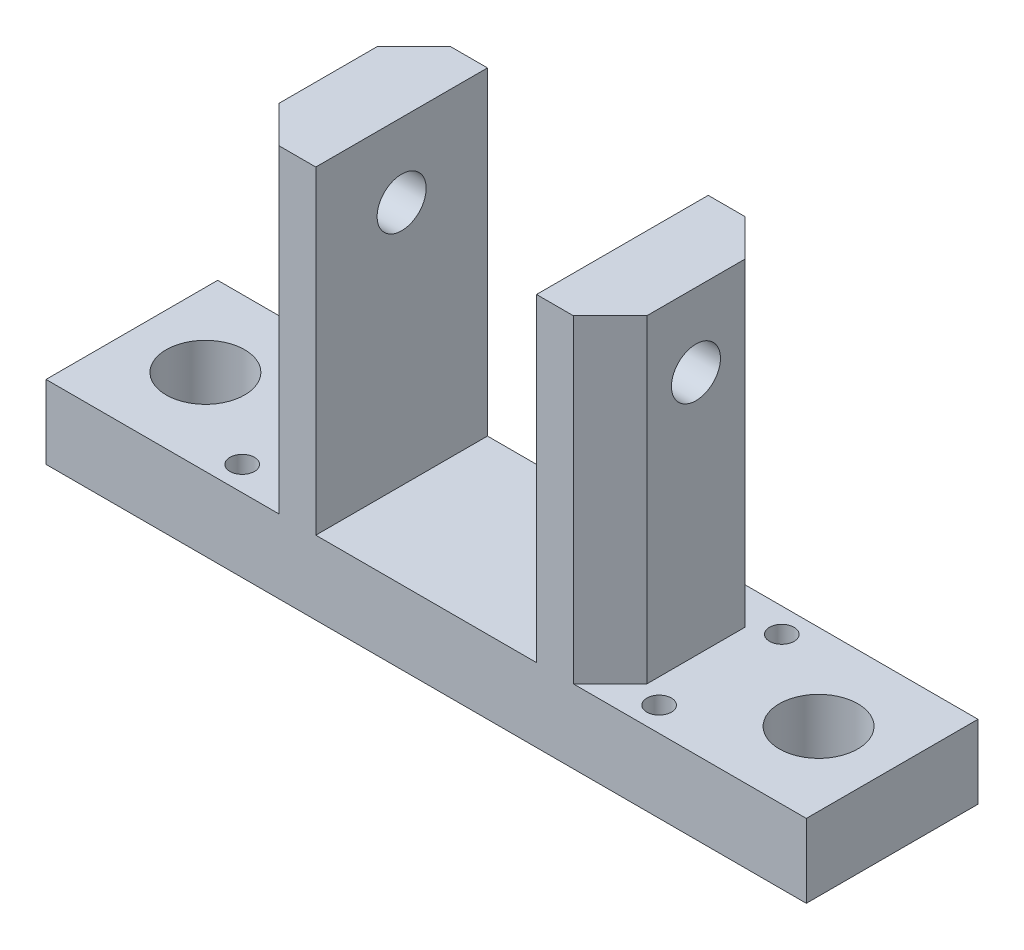
ISO-10303-21;
HEADER;
FILE_DESCRIPTION(('STEP AP214'),'2;1');
FILE_NAME('part.step','',(''),(''),'','','');
FILE_SCHEMA(('AUTOMOTIVE_DESIGN { 1 0 10303 214 1 1 1 1 }'));
ENDSEC;
DATA;
#1=APPLICATION_CONTEXT('core data for automotive mechanical design processes');
#2=APPLICATION_PROTOCOL_DEFINITION('international standard','automotive_design',2000,#1);
#3=PRODUCT_CONTEXT('',#1,'mechanical');
#4=PRODUCT('Part','Part','',(#3));
#5=PRODUCT_RELATED_PRODUCT_CATEGORY('part','',(#4));
#6=PRODUCT_DEFINITION_FORMATION('','',#4);
#7=PRODUCT_DEFINITION_CONTEXT('part definition',#1,'design');
#8=PRODUCT_DEFINITION('design','',#6,#7);
#9=PRODUCT_DEFINITION_SHAPE('','',#8);
#10=(LENGTH_UNIT() NAMED_UNIT(*) SI_UNIT(.MILLI.,.METRE.));
#11=(NAMED_UNIT(*) PLANE_ANGLE_UNIT() SI_UNIT($,.RADIAN.));
#12=(NAMED_UNIT(*) SI_UNIT($,.STERADIAN.) SOLID_ANGLE_UNIT());
#13=UNCERTAINTY_MEASURE_WITH_UNIT(LENGTH_MEASURE(1.E-05),#10,'distance_accuracy_value','');
#14=(GEOMETRIC_REPRESENTATION_CONTEXT(3) GLOBAL_UNCERTAINTY_ASSIGNED_CONTEXT((#13)) GLOBAL_UNIT_ASSIGNED_CONTEXT((#10,
#11,#12)) REPRESENTATION_CONTEXT('',''));
#15=CARTESIAN_POINT('',(0.,0.,0.));
#16=DIRECTION('',(0.,0.,1.));
#17=DIRECTION('',(1.,0.,0.));
#18=AXIS2_PLACEMENT_3D('',#15,#16,#17);
#19=CARTESIAN_POINT('',(0.,3.,3.5));
#20=DIRECTION('',(-1.,0.,0.));
#21=DIRECTION('',(0.,-1.,0.));
#22=AXIS2_PLACEMENT_3D('',#19,#20,#21);
#23=PLANE('',#22);
#24=DIRECTION('',(0.,1.,0.));
#25=VECTOR('',#24,1.);
#26=CARTESIAN_POINT('',(0.,3.,-3.5));
#27=LINE('',#26,#25);
#28=CARTESIAN_POINT('',(0.,0.,-3.5));
#29=VERTEX_POINT('',#28);
#30=CARTESIAN_POINT('',(0.,3.,-3.5));
#31=VERTEX_POINT('',#30);
#32=EDGE_CURVE('E147',#29,#31,#27,.T.);
#33=ORIENTED_EDGE('',*,*,#32,.T.);
#34=DIRECTION('',(0.,0.,-1.));
#35=VECTOR('',#34,1.);
#36=CARTESIAN_POINT('',(0.,3.,3.5));
#37=LINE('',#36,#35);
#38=CARTESIAN_POINT('',(0.,3.,3.5));
#39=VERTEX_POINT('',#38);
#40=EDGE_CURVE('E155',#39,#31,#37,.T.);
#41=ORIENTED_EDGE('',*,*,#40,.F.);
#42=DIRECTION('',(0.,1.,0.));
#43=VECTOR('',#42,1.);
#44=CARTESIAN_POINT('',(0.,3.,3.5));
#45=LINE('',#44,#43);
#46=CARTESIAN_POINT('',(0.,0.,3.5));
#47=VERTEX_POINT('',#46);
#48=EDGE_CURVE('E190',#47,#39,#45,.T.);
#49=ORIENTED_EDGE('',*,*,#48,.F.);
#50=DIRECTION('',(0.,0.,-1.));
#51=VECTOR('',#50,1.);
#52=CARTESIAN_POINT('',(0.,0.,3.5));
#53=LINE('',#52,#51);
#54=EDGE_CURVE('E167',#47,#29,#53,.T.);
#55=ORIENTED_EDGE('',*,*,#54,.T.);
#56=EDGE_LOOP('',(#33,#41,#49,#55));
#57=FACE_BOUND('',#56,.T.);
#58=ADVANCED_FACE('F27',(#57),#23,.F.);
#59=CARTESIAN_POINT('',(-8.,3.,3.5));
#60=DIRECTION('',(0.,-1.,0.));
#61=DIRECTION('',(0.,0.,-1.));
#62=AXIS2_PLACEMENT_3D('',#59,#60,#61);
#63=PLANE('',#62);
#64=CARTESIAN_POINT('',(-7.,3.,-2.5));
#65=DIRECTION('',(0.,1.,0.));
#66=DIRECTION('',(0.,0.,1.));
#67=AXIS2_PLACEMENT_3D('',#64,#65,#66);
#68=CIRCLE('',#67,0.5);
#69=CARTESIAN_POINT('',(-7.,3.,-2.));
#70=VERTEX_POINT('',#69);
#71=EDGE_CURVE('E509',#70,#70,#68,.T.);
#72=ORIENTED_EDGE('',*,*,#71,.F.);
#73=EDGE_LOOP('',(#72));
#74=FACE_BOUND('',#73,.T.);
#75=CARTESIAN_POINT('',(-7.,3.,2.5));
#76=DIRECTION('',(0.,1.,0.));
#77=DIRECTION('',(0.,0.,1.));
#78=AXIS2_PLACEMENT_3D('',#75,#76,#77);
#79=CIRCLE('',#78,0.5);
#80=CARTESIAN_POINT('',(-7.,3.,3.));
#81=VERTEX_POINT('',#80);
#82=EDGE_CURVE('E515',#81,#81,#79,.T.);
#83=ORIENTED_EDGE('',*,*,#82,.F.);
#84=EDGE_LOOP('',(#83));
#85=FACE_BOUND('',#84,.T.);
#86=CARTESIAN_POINT('',(-3.,3.,0.));
#87=DIRECTION('',(0.,1.,0.));
#88=DIRECTION('',(0.,0.,1.));
#89=AXIS2_PLACEMENT_3D('',#86,#87,#88);
#90=CIRCLE('',#89,1.6);
#91=CARTESIAN_POINT('',(-3.,3.,1.6));
#92=VERTEX_POINT('',#91);
#93=EDGE_CURVE('E533',#92,#92,#90,.T.);
#94=ORIENTED_EDGE('',*,*,#93,.F.);
#95=EDGE_LOOP('',(#94));
#96=FACE_BOUND('',#95,.T.);
#97=DIRECTION('',(-1.,0.,0.));
#98=VECTOR('',#97,1.);
#99=CARTESIAN_POINT('',(-8.,3.,-3.5));
#100=LINE('',#99,#98);
#101=CARTESIAN_POINT('',(-9.5,3.,-3.5));
#102=VERTEX_POINT('',#101);
#103=EDGE_CURVE('E141',#31,#102,#100,.T.);
#104=ORIENTED_EDGE('',*,*,#103,.T.);
#105=DIRECTION('',(-0.707106781186548,0.,-0.707106781186547));
#106=VECTOR('',#105,1.);
#107=CARTESIAN_POINT('',(-5.25,3.,0.749999999999994));
#108=LINE('',#107,#106);
#109=CARTESIAN_POINT('',(-8.,3.,-2.));
#110=VERTEX_POINT('',#109);
#111=EDGE_CURVE('E263',#102,#110,#108,.F.);
#112=ORIENTED_EDGE('',*,*,#111,.T.);
#113=DIRECTION('',(0.,0.,-1.));
#114=VECTOR('',#113,1.);
#115=CARTESIAN_POINT('',(-8.,3.,3.5));
#116=LINE('',#115,#114);
#117=CARTESIAN_POINT('',(-8.,3.,2.));
#118=VERTEX_POINT('',#117);
#119=EDGE_CURVE('E163',#118,#110,#116,.T.);
#120=ORIENTED_EDGE('',*,*,#119,.F.);
#121=DIRECTION('',(-0.707106781186546,0.,0.707106781186549));
#122=VECTOR('',#121,1.);
#123=CARTESIAN_POINT('',(-8.75,3.,2.75));
#124=LINE('',#123,#122);
#125=CARTESIAN_POINT('',(-9.49999999999999,3.,3.5));
#126=VERTEX_POINT('',#125);
#127=EDGE_CURVE('E265',#118,#126,#124,.T.);
#128=ORIENTED_EDGE('',*,*,#127,.T.);
#129=DIRECTION('',(-1.,0.,0.));
#130=VECTOR('',#129,1.);
#131=CARTESIAN_POINT('',(-8.,3.,3.5));
#132=LINE('',#131,#130);
#133=EDGE_CURVE('E158',#39,#126,#132,.T.);
#134=ORIENTED_EDGE('',*,*,#133,.F.);
#135=ORIENTED_EDGE('',*,*,#40,.T.);
#136=EDGE_LOOP('',(#104,#112,#120,#128,#134,#135));
#137=FACE_BOUND('',#136,.T.);
#138=ADVANCED_FACE('F156',(#74,#85,#96,#137),#63,.F.);
#139=CARTESIAN_POINT('',(-8.,16.,3.5));
#140=DIRECTION('',(-1.,0.,0.));
#141=DIRECTION('',(0.,-1.,0.));
#142=AXIS2_PLACEMENT_3D('',#139,#140,#141);
#143=PLANE('',#142);
#144=CARTESIAN_POINT('',(-8.,13.,0.));
#145=DIRECTION('',(-1.,0.,0.));
#146=DIRECTION('',(0.,-1.,0.));
#147=AXIS2_PLACEMENT_3D('',#144,#145,#146);
#148=CIRCLE('',#147,1.);
#149=CARTESIAN_POINT('',(-8.,12.,0.));
#150=VERTEX_POINT('',#149);
#151=EDGE_CURVE('E503',#150,#150,#148,.T.);
#152=ORIENTED_EDGE('',*,*,#151,.T.);
#153=EDGE_LOOP('',(#152));
#154=FACE_BOUND('',#153,.T.);
#155=ORIENTED_EDGE('',*,*,#119,.T.);
#156=DIRECTION('',(0.,1.,0.));
#157=VECTOR('',#156,1.);
#158=CARTESIAN_POINT('',(-8.,16.,-2.));
#159=LINE('',#158,#157);
#160=CARTESIAN_POINT('',(-8.,16.,-2.));
#161=VERTEX_POINT('',#160);
#162=EDGE_CURVE('E240',#110,#161,#159,.T.);
#163=ORIENTED_EDGE('',*,*,#162,.T.);
#164=DIRECTION('',(0.,0.,-1.));
#165=VECTOR('',#164,1.);
#166=CARTESIAN_POINT('',(-8.,16.,3.5));
#167=LINE('',#166,#165);
#168=CARTESIAN_POINT('',(-8.,16.,2.));
#169=VERTEX_POINT('',#168);
#170=EDGE_CURVE('E234',#169,#161,#167,.T.);
#171=ORIENTED_EDGE('',*,*,#170,.F.);
#172=DIRECTION('',(0.,-1.,0.));
#173=VECTOR('',#172,1.);
#174=CARTESIAN_POINT('',(-8.,3.,2.));
#175=LINE('',#174,#173);
#176=EDGE_CURVE('E162',#169,#118,#175,.T.);
#177=ORIENTED_EDGE('',*,*,#176,.T.);
#178=EDGE_LOOP('',(#155,#163,#171,#177));
#179=FACE_BOUND('',#178,.T.);
#180=ADVANCED_FACE('F312',(#154,#179),#143,.F.);
#181=CARTESIAN_POINT('',(-11.,16.,3.5));
#182=DIRECTION('',(0.,-1.,0.));
#183=DIRECTION('',(0.,0.,-1.));
#184=AXIS2_PLACEMENT_3D('',#181,#182,#183);
#185=PLANE('',#184);
#186=ORIENTED_EDGE('',*,*,#170,.T.);
#187=DIRECTION('',(0.707106781186548,0.,0.707106781186547));
#188=VECTOR('',#187,1.);
#189=CARTESIAN_POINT('',(-8.,16.,-2.));
#190=LINE('',#189,#188);
#191=CARTESIAN_POINT('',(-9.50000000000001,16.,-3.5));
#192=VERTEX_POINT('',#191);
#193=EDGE_CURVE('E245',#161,#192,#190,.F.);
#194=ORIENTED_EDGE('',*,*,#193,.T.);
#195=DIRECTION('',(-1.,0.,0.));
#196=VECTOR('',#195,1.);
#197=CARTESIAN_POINT('',(-11.,16.,-3.5));
#198=LINE('',#197,#196);
#199=CARTESIAN_POINT('',(-11.,16.,-3.5));
#200=VERTEX_POINT('',#199);
#201=EDGE_CURVE('E152',#192,#200,#198,.T.);
#202=ORIENTED_EDGE('',*,*,#201,.T.);
#203=DIRECTION('',(0.,0.,-1.));
#204=VECTOR('',#203,1.);
#205=CARTESIAN_POINT('',(-11.,16.,3.5));
#206=LINE('',#205,#204);
#207=CARTESIAN_POINT('',(-11.,16.,3.5));
#208=VERTEX_POINT('',#207);
#209=EDGE_CURVE('E231',#208,#200,#206,.T.);
#210=ORIENTED_EDGE('',*,*,#209,.F.);
#211=DIRECTION('',(-1.,0.,0.));
#212=VECTOR('',#211,1.);
#213=CARTESIAN_POINT('',(-11.,16.,3.5));
#214=LINE('',#213,#212);
#215=CARTESIAN_POINT('',(-9.5,16.,3.5));
#216=VERTEX_POINT('',#215);
#217=EDGE_CURVE('E193',#216,#208,#214,.T.);
#218=ORIENTED_EDGE('',*,*,#217,.F.);
#219=DIRECTION('',(0.707106781186546,0.,-0.707106781186549));
#220=VECTOR('',#219,1.);
#221=CARTESIAN_POINT('',(-9.49999999999999,16.,3.5));
#222=LINE('',#221,#220);
#223=EDGE_CURVE('E243',#216,#169,#222,.T.);
#224=ORIENTED_EDGE('',*,*,#223,.T.);
#225=EDGE_LOOP('',(#186,#194,#202,#210,#218,#224));
#226=FACE_BOUND('',#225,.T.);
#227=ADVANCED_FACE('F309',(#226),#185,.F.);
#228=CARTESIAN_POINT('',(-11.,3.,3.5));
#229=DIRECTION('',(1.,0.,0.));
#230=DIRECTION('',(0.,0.,-1.));
#231=AXIS2_PLACEMENT_3D('',#228,#229,#230);
#232=PLANE('',#231);
#233=CARTESIAN_POINT('',(-11.,13.,0.));
#234=DIRECTION('',(1.,0.,0.));
#235=DIRECTION('',(0.,0.,-1.));
#236=AXIS2_PLACEMENT_3D('',#233,#234,#235);
#237=CIRCLE('',#236,1.);
#238=CARTESIAN_POINT('',(-11.,13.,-1.));
#239=VERTEX_POINT('',#238);
#240=EDGE_CURVE('E500',#239,#239,#237,.T.);
#241=ORIENTED_EDGE('',*,*,#240,.T.);
#242=EDGE_LOOP('',(#241));
#243=FACE_BOUND('',#242,.T.);
#244=DIRECTION('',(0.,-1.,0.));
#245=VECTOR('',#244,1.);
#246=CARTESIAN_POINT('',(-11.,3.,-3.5));
#247=LINE('',#246,#245);
#248=CARTESIAN_POINT('',(-11.,3.,-3.5));
#249=VERTEX_POINT('',#248);
#250=EDGE_CURVE('E176',#200,#249,#247,.T.);
#251=ORIENTED_EDGE('',*,*,#250,.T.);
#252=DIRECTION('',(0.,0.,-1.));
#253=VECTOR('',#252,1.);
#254=CARTESIAN_POINT('',(-11.,3.,3.5));
#255=LINE('',#254,#253);
#256=CARTESIAN_POINT('',(-11.,3.,3.5));
#257=VERTEX_POINT('',#256);
#258=EDGE_CURVE('E228',#257,#249,#255,.T.);
#259=ORIENTED_EDGE('',*,*,#258,.F.);
#260=DIRECTION('',(0.,-1.,0.));
#261=VECTOR('',#260,1.);
#262=CARTESIAN_POINT('',(-11.,3.,3.5));
#263=LINE('',#262,#261);
#264=EDGE_CURVE('E195',#208,#257,#263,.T.);
#265=ORIENTED_EDGE('',*,*,#264,.F.);
#266=ORIENTED_EDGE('',*,*,#209,.T.);
#267=EDGE_LOOP('',(#251,#259,#265,#266));
#268=FACE_BOUND('',#267,.T.);
#269=ADVANCED_FACE('F319',(#243,#268),#232,.F.);
#270=CARTESIAN_POINT('',(-20.,3.,3.5));
#271=DIRECTION('',(0.,-1.,0.));
#272=DIRECTION('',(1.,0.,0.));
#273=AXIS2_PLACEMENT_3D('',#270,#271,#272);
#274=PLANE('',#273);
#275=DIRECTION('',(-1.,0.,0.));
#276=VECTOR('',#275,1.);
#277=CARTESIAN_POINT('',(-20.,3.,-3.5));
#278=LINE('',#277,#276);
#279=CARTESIAN_POINT('',(-20.,3.,-3.5));
#280=VERTEX_POINT('',#279);
#281=EDGE_CURVE('E178',#249,#280,#278,.T.);
#282=ORIENTED_EDGE('',*,*,#281,.T.);
#283=DIRECTION('',(0.,0.,-1.));
#284=VECTOR('',#283,1.);
#285=CARTESIAN_POINT('',(-20.,3.,3.5));
#286=LINE('',#285,#284);
#287=CARTESIAN_POINT('',(-20.,3.,3.5));
#288=VERTEX_POINT('',#287);
#289=EDGE_CURVE('E225',#288,#280,#286,.T.);
#290=ORIENTED_EDGE('',*,*,#289,.F.);
#291=DIRECTION('',(-1.,0.,0.));
#292=VECTOR('',#291,1.);
#293=CARTESIAN_POINT('',(-20.,3.,3.5));
#294=LINE('',#293,#292);
#295=EDGE_CURVE('E197',#257,#288,#294,.T.);
#296=ORIENTED_EDGE('',*,*,#295,.F.);
#297=ORIENTED_EDGE('',*,*,#258,.T.);
#298=EDGE_LOOP('',(#282,#290,#296,#297));
#299=FACE_BOUND('',#298,.T.);
#300=ADVANCED_FACE('F322',(#299),#274,.F.);
#301=CARTESIAN_POINT('',(-20.,16.,3.5));
#302=DIRECTION('',(-1.,0.,0.));
#303=DIRECTION('',(0.,0.,1.));
#304=AXIS2_PLACEMENT_3D('',#301,#302,#303);
#305=PLANE('',#304);
#306=CARTESIAN_POINT('',(-20.,13.,0.));
#307=DIRECTION('',(-1.,0.,0.));
#308=DIRECTION('',(0.,0.,1.));
#309=AXIS2_PLACEMENT_3D('',#306,#307,#308);
#310=CIRCLE('',#309,1.);
#311=CARTESIAN_POINT('',(-20.,13.,1.));
#312=VERTEX_POINT('',#311);
#313=EDGE_CURVE('E499',#312,#312,#310,.T.);
#314=ORIENTED_EDGE('',*,*,#313,.T.);
#315=EDGE_LOOP('',(#314));
#316=FACE_BOUND('',#315,.T.);
#317=DIRECTION('',(0.,1.,0.));
#318=VECTOR('',#317,1.);
#319=CARTESIAN_POINT('',(-20.,16.,-3.5));
#320=LINE('',#319,#318);
#321=CARTESIAN_POINT('',(-20.,16.,-3.5));
#322=VERTEX_POINT('',#321);
#323=EDGE_CURVE('E180',#280,#322,#320,.T.);
#324=ORIENTED_EDGE('',*,*,#323,.T.);
#325=DIRECTION('',(0.,0.,-1.));
#326=VECTOR('',#325,1.);
#327=CARTESIAN_POINT('',(-20.,16.,3.5));
#328=LINE('',#327,#326);
#329=CARTESIAN_POINT('',(-20.,16.,3.5));
#330=VERTEX_POINT('',#329);
#331=EDGE_CURVE('E222',#330,#322,#328,.T.);
#332=ORIENTED_EDGE('',*,*,#331,.F.);
#333=DIRECTION('',(0.,1.,0.));
#334=VECTOR('',#333,1.);
#335=CARTESIAN_POINT('',(-20.,16.,3.5));
#336=LINE('',#335,#334);
#337=EDGE_CURVE('E199',#288,#330,#336,.T.);
#338=ORIENTED_EDGE('',*,*,#337,.F.);
#339=ORIENTED_EDGE('',*,*,#289,.T.);
#340=EDGE_LOOP('',(#324,#332,#338,#339));
#341=FACE_BOUND('',#340,.T.);
#342=ADVANCED_FACE('F285',(#316,#341),#305,.F.);
#343=CARTESIAN_POINT('',(-23.,16.,3.5));
#344=DIRECTION('',(0.,-1.,0.));
#345=DIRECTION('',(0.,0.,-1.));
#346=AXIS2_PLACEMENT_3D('',#343,#344,#345);
#347=PLANE('',#346);
#348=DIRECTION('',(0.,0.,-1.));
#349=VECTOR('',#348,1.);
#350=CARTESIAN_POINT('',(-23.,16.,3.5));
#351=LINE('',#350,#349);
#352=CARTESIAN_POINT('',(-23.,16.,2.));
#353=VERTEX_POINT('',#352);
#354=CARTESIAN_POINT('',(-23.,16.,-2.));
#355=VERTEX_POINT('',#354);
#356=EDGE_CURVE('E220',#353,#355,#351,.T.);
#357=ORIENTED_EDGE('',*,*,#356,.F.);
#358=DIRECTION('',(0.707106781186545,0.,0.70710678118655));
#359=VECTOR('',#358,1.);
#360=CARTESIAN_POINT('',(-21.5,16.,3.5));
#361=LINE('',#360,#359);
#362=CARTESIAN_POINT('',(-21.5,16.,3.5));
#363=VERTEX_POINT('',#362);
#364=EDGE_CURVE('E261',#353,#363,#361,.T.);
#365=ORIENTED_EDGE('',*,*,#364,.T.);
#366=DIRECTION('',(-1.,0.,0.));
#367=VECTOR('',#366,1.);
#368=CARTESIAN_POINT('',(-23.,16.,3.5));
#369=LINE('',#368,#367);
#370=EDGE_CURVE('E201',#330,#363,#369,.T.);
#371=ORIENTED_EDGE('',*,*,#370,.F.);
#372=ORIENTED_EDGE('',*,*,#331,.T.);
#373=DIRECTION('',(-1.,0.,0.));
#374=VECTOR('',#373,1.);
#375=CARTESIAN_POINT('',(-23.,16.,-3.5));
#376=LINE('',#375,#374);
#377=CARTESIAN_POINT('',(-21.5,16.,-3.5));
#378=VERTEX_POINT('',#377);
#379=EDGE_CURVE('E182',#322,#378,#376,.T.);
#380=ORIENTED_EDGE('',*,*,#379,.T.);
#381=DIRECTION('',(0.707106781186548,0.,-0.707106781186547));
#382=VECTOR('',#381,1.);
#383=CARTESIAN_POINT('',(-23.,16.,-2.));
#384=LINE('',#383,#382);
#385=EDGE_CURVE('E41',#378,#355,#384,.F.);
#386=ORIENTED_EDGE('',*,*,#385,.T.);
#387=EDGE_LOOP('',(#357,#365,#371,#372,#380,#386));
#388=FACE_BOUND('',#387,.T.);
#389=ADVANCED_FACE('F277',(#388),#347,.F.);
#390=CARTESIAN_POINT('',(-23.,3.,3.5));
#391=DIRECTION('',(1.,0.,0.));
#392=DIRECTION('',(0.,0.,-1.));
#393=AXIS2_PLACEMENT_3D('',#390,#391,#392);
#394=PLANE('',#393);
#395=CARTESIAN_POINT('',(-23.,13.,0.));
#396=DIRECTION('',(-1.,0.,0.));
#397=DIRECTION('',(0.,0.,1.));
#398=AXIS2_PLACEMENT_3D('',#395,#396,#397);
#399=CIRCLE('',#398,1.);
#400=CARTESIAN_POINT('',(-23.,13.,1.));
#401=VERTEX_POINT('',#400);
#402=EDGE_CURVE('E496',#401,#401,#399,.T.);
#403=ORIENTED_EDGE('',*,*,#402,.F.);
#404=EDGE_LOOP('',(#403));
#405=FACE_BOUND('',#404,.T.);
#406=DIRECTION('',(0.,0.,-1.));
#407=VECTOR('',#406,1.);
#408=CARTESIAN_POINT('',(-23.,3.,3.5));
#409=LINE('',#408,#407);
#410=CARTESIAN_POINT('',(-23.,3.,2.));
#411=VERTEX_POINT('',#410);
#412=CARTESIAN_POINT('',(-23.,3.,-2.));
#413=VERTEX_POINT('',#412);
#414=EDGE_CURVE('E217',#411,#413,#409,.T.);
#415=ORIENTED_EDGE('',*,*,#414,.F.);
#416=DIRECTION('',(0.,1.,0.));
#417=VECTOR('',#416,1.);
#418=CARTESIAN_POINT('',(-23.,16.,2.));
#419=LINE('',#418,#417);
#420=EDGE_CURVE('E48',#411,#353,#419,.T.);
#421=ORIENTED_EDGE('',*,*,#420,.T.);
#422=ORIENTED_EDGE('',*,*,#356,.T.);
#423=DIRECTION('',(0.,-1.,0.));
#424=VECTOR('',#423,1.);
#425=CARTESIAN_POINT('',(-23.,3.,-2.));
#426=LINE('',#425,#424);
#427=EDGE_CURVE('E256',#355,#413,#426,.T.);
#428=ORIENTED_EDGE('',*,*,#427,.T.);
#429=EDGE_LOOP('',(#415,#421,#422,#428));
#430=FACE_BOUND('',#429,.T.);
#431=ADVANCED_FACE('F272',(#405,#430),#394,.F.);
#432=CARTESIAN_POINT('',(-31.,3.,3.5));
#433=DIRECTION('',(0.,-1.,0.));
#434=DIRECTION('',(0.,0.,-1.));
#435=AXIS2_PLACEMENT_3D('',#432,#433,#434);
#436=PLANE('',#435);
#437=CARTESIAN_POINT('',(-24.,3.,2.5));
#438=DIRECTION('',(0.,1.,0.));
#439=DIRECTION('',(0.,0.,1.));
#440=AXIS2_PLACEMENT_3D('',#437,#438,#439);
#441=CIRCLE('',#440,0.499999999999999);
#442=CARTESIAN_POINT('',(-24.,3.,3.));
#443=VERTEX_POINT('',#442);
#444=EDGE_CURVE('E521',#443,#443,#441,.T.);
#445=ORIENTED_EDGE('',*,*,#444,.F.);
#446=EDGE_LOOP('',(#445));
#447=FACE_BOUND('',#446,.T.);
#448=CARTESIAN_POINT('',(-24.,3.,-2.5));
#449=DIRECTION('',(0.,1.,0.));
#450=DIRECTION('',(0.,0.,1.));
#451=AXIS2_PLACEMENT_3D('',#448,#449,#450);
#452=CIRCLE('',#451,0.499999999999999);
#453=CARTESIAN_POINT('',(-24.,3.,-2.));
#454=VERTEX_POINT('',#453);
#455=EDGE_CURVE('E527',#454,#454,#452,.T.);
#456=ORIENTED_EDGE('',*,*,#455,.F.);
#457=EDGE_LOOP('',(#456));
#458=FACE_BOUND('',#457,.T.);
#459=CARTESIAN_POINT('',(-28.,3.,0.));
#460=DIRECTION('',(0.,1.,0.));
#461=DIRECTION('',(0.,0.,1.));
#462=AXIS2_PLACEMENT_3D('',#459,#460,#461);
#463=CIRCLE('',#462,1.6);
#464=CARTESIAN_POINT('',(-28.,3.,1.6));
#465=VERTEX_POINT('',#464);
#466=EDGE_CURVE('E171',#465,#465,#463,.T.);
#467=ORIENTED_EDGE('',*,*,#466,.F.);
#468=EDGE_LOOP('',(#467));
#469=FACE_BOUND('',#468,.T.);
#470=DIRECTION('',(-1.,0.,0.));
#471=VECTOR('',#470,1.);
#472=CARTESIAN_POINT('',(-31.,3.,-3.5));
#473=LINE('',#472,#471);
#474=CARTESIAN_POINT('',(-21.5,3.,-3.5));
#475=VERTEX_POINT('',#474);
#476=CARTESIAN_POINT('',(-31.,3.,-3.5));
#477=VERTEX_POINT('',#476);
#478=EDGE_CURVE('E184',#475,#477,#473,.T.);
#479=ORIENTED_EDGE('',*,*,#478,.T.);
#480=DIRECTION('',(0.,0.,-1.));
#481=VECTOR('',#480,1.);
#482=CARTESIAN_POINT('',(-31.,3.,3.5));
#483=LINE('',#482,#481);
#484=CARTESIAN_POINT('',(-31.,3.,3.5));
#485=VERTEX_POINT('',#484);
#486=EDGE_CURVE('E214',#485,#477,#483,.T.);
#487=ORIENTED_EDGE('',*,*,#486,.F.);
#488=DIRECTION('',(-1.,0.,0.));
#489=VECTOR('',#488,1.);
#490=CARTESIAN_POINT('',(-31.,3.,3.5));
#491=LINE('',#490,#489);
#492=CARTESIAN_POINT('',(-21.5,3.,3.5));
#493=VERTEX_POINT('',#492);
#494=EDGE_CURVE('E204',#493,#485,#491,.T.);
#495=ORIENTED_EDGE('',*,*,#494,.F.);
#496=DIRECTION('',(-0.707106781186545,0.,-0.70710678118655));
#497=VECTOR('',#496,1.);
#498=CARTESIAN_POINT('',(-26.25,3.,-1.25));
#499=LINE('',#498,#497);
#500=EDGE_CURVE('E34',#493,#411,#499,.T.);
#501=ORIENTED_EDGE('',*,*,#500,.T.);
#502=ORIENTED_EDGE('',*,*,#414,.T.);
#503=DIRECTION('',(-0.707106781186548,0.,0.707106781186547));
#504=VECTOR('',#503,1.);
#505=CARTESIAN_POINT('',(-29.75,3.,4.74999999999999));
#506=LINE('',#505,#504);
#507=EDGE_CURVE('E11',#413,#475,#506,.F.);
#508=ORIENTED_EDGE('',*,*,#507,.T.);
#509=EDGE_LOOP('',(#479,#487,#495,#501,#502,#508));
#510=FACE_BOUND('',#509,.T.);
#511=ADVANCED_FACE('F268',(#447,#458,#469,#510),#436,.F.);
#512=CARTESIAN_POINT('',(-31.,0.,3.5));
#513=DIRECTION('',(1.,0.,0.));
#514=DIRECTION('',(0.,0.,-1.));
#515=AXIS2_PLACEMENT_3D('',#512,#513,#514);
#516=PLANE('',#515);
#517=DIRECTION('',(0.,-1.,0.));
#518=VECTOR('',#517,1.);
#519=CARTESIAN_POINT('',(-31.,0.,-3.5));
#520=LINE('',#519,#518);
#521=CARTESIAN_POINT('',(-31.,0.,-3.5));
#522=VERTEX_POINT('',#521);
#523=EDGE_CURVE('E186',#477,#522,#520,.T.);
#524=ORIENTED_EDGE('',*,*,#523,.T.);
#525=DIRECTION('',(0.,0.,-1.));
#526=VECTOR('',#525,1.);
#527=CARTESIAN_POINT('',(-31.,0.,3.5));
#528=LINE('',#527,#526);
#529=CARTESIAN_POINT('',(-31.,0.,3.5));
#530=VERTEX_POINT('',#529);
#531=EDGE_CURVE('E211',#530,#522,#528,.T.);
#532=ORIENTED_EDGE('',*,*,#531,.F.);
#533=DIRECTION('',(0.,-1.,0.));
#534=VECTOR('',#533,1.);
#535=CARTESIAN_POINT('',(-31.,0.,3.5));
#536=LINE('',#535,#534);
#537=EDGE_CURVE('E206',#485,#530,#536,.T.);
#538=ORIENTED_EDGE('',*,*,#537,.F.);
#539=ORIENTED_EDGE('',*,*,#486,.T.);
#540=EDGE_LOOP('',(#524,#532,#538,#539));
#541=FACE_BOUND('',#540,.T.);
#542=ADVANCED_FACE('F295',(#541),#516,.F.);
#543=CARTESIAN_POINT('',(0.,0.,3.5));
#544=DIRECTION('',(0.,1.,0.));
#545=DIRECTION('',(-1.,0.,0.));
#546=AXIS2_PLACEMENT_3D('',#543,#544,#545);
#547=PLANE('',#546);
#548=CARTESIAN_POINT('',(-7.,0.,-2.5));
#549=DIRECTION('',(0.,1.,0.));
#550=DIRECTION('',(0.,0.,1.));
#551=AXIS2_PLACEMENT_3D('',#548,#549,#550);
#552=CIRCLE('',#551,0.5);
#553=CARTESIAN_POINT('',(-7.,0.,-2.));
#554=VERTEX_POINT('',#553);
#555=EDGE_CURVE('E512',#554,#554,#552,.T.);
#556=ORIENTED_EDGE('',*,*,#555,.T.);
#557=EDGE_LOOP('',(#556));
#558=FACE_BOUND('',#557,.T.);
#559=CARTESIAN_POINT('',(-7.,0.,2.5));
#560=DIRECTION('',(0.,1.,0.));
#561=DIRECTION('',(0.,0.,1.));
#562=AXIS2_PLACEMENT_3D('',#559,#560,#561);
#563=CIRCLE('',#562,0.5);
#564=CARTESIAN_POINT('',(-7.,0.,3.));
#565=VERTEX_POINT('',#564);
#566=EDGE_CURVE('E518',#565,#565,#563,.T.);
#567=ORIENTED_EDGE('',*,*,#566,.T.);
#568=EDGE_LOOP('',(#567));
#569=FACE_BOUND('',#568,.T.);
#570=CARTESIAN_POINT('',(-24.,0.,2.5));
#571=DIRECTION('',(0.,1.,0.));
#572=DIRECTION('',(0.,0.,1.));
#573=AXIS2_PLACEMENT_3D('',#570,#571,#572);
#574=CIRCLE('',#573,0.499999999999999);
#575=CARTESIAN_POINT('',(-24.,0.,3.));
#576=VERTEX_POINT('',#575);
#577=EDGE_CURVE('E524',#576,#576,#574,.T.);
#578=ORIENTED_EDGE('',*,*,#577,.T.);
#579=EDGE_LOOP('',(#578));
#580=FACE_BOUND('',#579,.T.);
#581=CARTESIAN_POINT('',(-24.,0.,-2.5));
#582=DIRECTION('',(0.,1.,0.));
#583=DIRECTION('',(0.,0.,1.));
#584=AXIS2_PLACEMENT_3D('',#581,#582,#583);
#585=CIRCLE('',#584,0.499999999999999);
#586=CARTESIAN_POINT('',(-24.,0.,-2.));
#587=VERTEX_POINT('',#586);
#588=EDGE_CURVE('E530',#587,#587,#585,.T.);
#589=ORIENTED_EDGE('',*,*,#588,.T.);
#590=EDGE_LOOP('',(#589));
#591=FACE_BOUND('',#590,.T.);
#592=CARTESIAN_POINT('',(-3.,0.,0.));
#593=DIRECTION('',(0.,1.,0.));
#594=DIRECTION('',(0.,0.,1.));
#595=AXIS2_PLACEMENT_3D('',#592,#593,#594);
#596=CIRCLE('',#595,1.6);
#597=CARTESIAN_POINT('',(-3.,0.,1.6));
#598=VERTEX_POINT('',#597);
#599=EDGE_CURVE('E536',#598,#598,#596,.T.);
#600=ORIENTED_EDGE('',*,*,#599,.T.);
#601=EDGE_LOOP('',(#600));
#602=FACE_BOUND('',#601,.T.);
#603=CARTESIAN_POINT('',(-28.,0.,0.));
#604=DIRECTION('',(0.,1.,0.));
#605=DIRECTION('',(0.,0.,1.));
#606=AXIS2_PLACEMENT_3D('',#603,#604,#605);
#607=CIRCLE('',#606,1.6);
#608=CARTESIAN_POINT('',(-28.,0.,1.6));
#609=VERTEX_POINT('',#608);
#610=EDGE_CURVE('E168',#609,#609,#607,.T.);
#611=ORIENTED_EDGE('',*,*,#610,.T.);
#612=EDGE_LOOP('',(#611));
#613=FACE_BOUND('',#612,.T.);
#614=DIRECTION('',(1.,0.,0.));
#615=VECTOR('',#614,1.);
#616=CARTESIAN_POINT('',(0.,0.,-3.5));
#617=LINE('',#616,#615);
#618=EDGE_CURVE('E188',#522,#29,#617,.T.);
#619=ORIENTED_EDGE('',*,*,#618,.T.);
#620=ORIENTED_EDGE('',*,*,#54,.F.);
#621=DIRECTION('',(1.,0.,0.));
#622=VECTOR('',#621,1.);
#623=CARTESIAN_POINT('',(0.,0.,3.5));
#624=LINE('',#623,#622);
#625=EDGE_CURVE('E208',#530,#47,#624,.T.);
#626=ORIENTED_EDGE('',*,*,#625,.F.);
#627=ORIENTED_EDGE('',*,*,#531,.T.);
#628=EDGE_LOOP('',(#619,#620,#626,#627));
#629=FACE_BOUND('',#628,.T.);
#630=ADVANCED_FACE('F298',(#558,#569,#580,#591,#602,#613,#629),#547,.F.);
#631=CARTESIAN_POINT('',(0.,3.,3.5));
#632=DIRECTION('',(0.,0.,1.));
#633=DIRECTION('',(1.,0.,0.));
#634=AXIS2_PLACEMENT_3D('',#631,#632,#633);
#635=PLANE('',#634);
#636=ORIENTED_EDGE('',*,*,#133,.T.);
#637=DIRECTION('',(0.,1.,0.));
#638=VECTOR('',#637,1.);
#639=CARTESIAN_POINT('',(-9.49999999999999,16.,3.5));
#640=LINE('',#639,#638);
#641=EDGE_CURVE('E253',#126,#216,#640,.T.);
#642=ORIENTED_EDGE('',*,*,#641,.T.);
#643=ORIENTED_EDGE('',*,*,#217,.T.);
#644=ORIENTED_EDGE('',*,*,#264,.T.);
#645=ORIENTED_EDGE('',*,*,#295,.T.);
#646=ORIENTED_EDGE('',*,*,#337,.T.);
#647=ORIENTED_EDGE('',*,*,#370,.T.);
#648=DIRECTION('',(0.,-1.,0.));
#649=VECTOR('',#648,1.);
#650=CARTESIAN_POINT('',(-21.5,3.,3.5));
#651=LINE('',#650,#649);
#652=EDGE_CURVE('E250',#363,#493,#651,.T.);
#653=ORIENTED_EDGE('',*,*,#652,.T.);
#654=ORIENTED_EDGE('',*,*,#494,.T.);
#655=ORIENTED_EDGE('',*,*,#537,.T.);
#656=ORIENTED_EDGE('',*,*,#625,.T.);
#657=ORIENTED_EDGE('',*,*,#48,.T.);
#658=EDGE_LOOP('',(#636,#642,#643,#644,#645,#646,#647,#653,#654,#655,#656,#657));
#659=FACE_BOUND('',#658,.T.);
#660=ADVANCED_FACE('F279',(#659),#635,.T.);
#661=CARTESIAN_POINT('',(0.,3.,-3.5));
#662=DIRECTION('',(0.,0.,1.));
#663=DIRECTION('',(1.,0.,0.));
#664=AXIS2_PLACEMENT_3D('',#661,#662,#663);
#665=PLANE('',#664);
#666=ORIENTED_EDGE('',*,*,#201,.F.);
#667=DIRECTION('',(0.,-1.,0.));
#668=VECTOR('',#667,1.);
#669=CARTESIAN_POINT('',(-9.5,3.,-3.5));
#670=LINE('',#669,#668);
#671=EDGE_CURVE('E149',#192,#102,#670,.T.);
#672=ORIENTED_EDGE('',*,*,#671,.T.);
#673=ORIENTED_EDGE('',*,*,#103,.F.);
#674=ORIENTED_EDGE('',*,*,#32,.F.);
#675=ORIENTED_EDGE('',*,*,#618,.F.);
#676=ORIENTED_EDGE('',*,*,#523,.F.);
#677=ORIENTED_EDGE('',*,*,#478,.F.);
#678=DIRECTION('',(0.,1.,0.));
#679=VECTOR('',#678,1.);
#680=CARTESIAN_POINT('',(-21.5,3.,-3.5));
#681=LINE('',#680,#679);
#682=EDGE_CURVE('E247',#475,#378,#681,.T.);
#683=ORIENTED_EDGE('',*,*,#682,.T.);
#684=ORIENTED_EDGE('',*,*,#379,.F.);
#685=ORIENTED_EDGE('',*,*,#323,.F.);
#686=ORIENTED_EDGE('',*,*,#281,.F.);
#687=ORIENTED_EDGE('',*,*,#250,.F.);
#688=EDGE_LOOP('',(#666,#672,#673,#674,#675,#676,#677,#683,#684,#685,#686,#687));
#689=FACE_BOUND('',#688,.T.);
#690=ADVANCED_FACE('F144',(#689),#665,.F.);
#691=CARTESIAN_POINT('',(-28.,0.,0.));
#692=DIRECTION('',(0.,1.,0.));
#693=DIRECTION('',(0.,0.,1.));
#694=AXIS2_PLACEMENT_3D('',#691,#692,#693);
#695=CYLINDRICAL_SURFACE('',#694,1.6);
#696=ORIENTED_EDGE('',*,*,#610,.F.);
#697=EDGE_LOOP('',(#696));
#698=FACE_BOUND('',#697,.T.);
#699=ORIENTED_EDGE('',*,*,#466,.T.);
#700=EDGE_LOOP('',(#699));
#701=FACE_BOUND('',#700,.T.);
#702=ADVANCED_FACE('F389',(#698,#701),#695,.F.);
#703=CARTESIAN_POINT('',(-3.,0.,0.));
#704=DIRECTION('',(0.,1.,0.));
#705=DIRECTION('',(0.,0.,1.));
#706=AXIS2_PLACEMENT_3D('',#703,#704,#705);
#707=CYLINDRICAL_SURFACE('',#706,1.6);
#708=ORIENTED_EDGE('',*,*,#599,.F.);
#709=EDGE_LOOP('',(#708));
#710=FACE_BOUND('',#709,.T.);
#711=ORIENTED_EDGE('',*,*,#93,.T.);
#712=EDGE_LOOP('',(#711));
#713=FACE_BOUND('',#712,.T.);
#714=ADVANCED_FACE('F438',(#710,#713),#707,.F.);
#715=CARTESIAN_POINT('',(-24.,0.,-2.5));
#716=DIRECTION('',(0.,1.,0.));
#717=DIRECTION('',(0.,0.,1.));
#718=AXIS2_PLACEMENT_3D('',#715,#716,#717);
#719=CYLINDRICAL_SURFACE('',#718,0.499999999999999);
#720=ORIENTED_EDGE('',*,*,#588,.F.);
#721=EDGE_LOOP('',(#720));
#722=FACE_BOUND('',#721,.T.);
#723=ORIENTED_EDGE('',*,*,#455,.T.);
#724=EDGE_LOOP('',(#723));
#725=FACE_BOUND('',#724,.T.);
#726=ADVANCED_FACE('F434',(#722,#725),#719,.F.);
#727=CARTESIAN_POINT('',(-24.,0.,2.5));
#728=DIRECTION('',(0.,1.,0.));
#729=DIRECTION('',(0.,0.,1.));
#730=AXIS2_PLACEMENT_3D('',#727,#728,#729);
#731=CYLINDRICAL_SURFACE('',#730,0.499999999999999);
#732=ORIENTED_EDGE('',*,*,#577,.F.);
#733=EDGE_LOOP('',(#732));
#734=FACE_BOUND('',#733,.T.);
#735=ORIENTED_EDGE('',*,*,#444,.T.);
#736=EDGE_LOOP('',(#735));
#737=FACE_BOUND('',#736,.T.);
#738=ADVANCED_FACE('F430',(#734,#737),#731,.F.);
#739=CARTESIAN_POINT('',(-7.,0.,2.5));
#740=DIRECTION('',(0.,1.,0.));
#741=DIRECTION('',(0.,0.,1.));
#742=AXIS2_PLACEMENT_3D('',#739,#740,#741);
#743=CYLINDRICAL_SURFACE('',#742,0.5);
#744=ORIENTED_EDGE('',*,*,#566,.F.);
#745=EDGE_LOOP('',(#744));
#746=FACE_BOUND('',#745,.T.);
#747=ORIENTED_EDGE('',*,*,#82,.T.);
#748=EDGE_LOOP('',(#747));
#749=FACE_BOUND('',#748,.T.);
#750=ADVANCED_FACE('F426',(#746,#749),#743,.F.);
#751=CARTESIAN_POINT('',(-7.,0.,-2.5));
#752=DIRECTION('',(0.,1.,0.));
#753=DIRECTION('',(0.,0.,1.));
#754=AXIS2_PLACEMENT_3D('',#751,#752,#753);
#755=CYLINDRICAL_SURFACE('',#754,0.5);
#756=ORIENTED_EDGE('',*,*,#555,.F.);
#757=EDGE_LOOP('',(#756));
#758=FACE_BOUND('',#757,.T.);
#759=ORIENTED_EDGE('',*,*,#71,.T.);
#760=EDGE_LOOP('',(#759));
#761=FACE_BOUND('',#760,.T.);
#762=ADVANCED_FACE('F423',(#758,#761),#755,.F.);
#763=CARTESIAN_POINT('',(0.,13.,0.));
#764=DIRECTION('',(-1.,0.,0.));
#765=DIRECTION('',(0.,0.,1.));
#766=AXIS2_PLACEMENT_3D('',#763,#764,#765);
#767=CYLINDRICAL_SURFACE('',#766,1.);
#768=ORIENTED_EDGE('',*,*,#402,.T.);
#769=EDGE_LOOP('',(#768));
#770=FACE_BOUND('',#769,.T.);
#771=ORIENTED_EDGE('',*,*,#313,.F.);
#772=EDGE_LOOP('',(#771));
#773=FACE_BOUND('',#772,.T.);
#774=ADVANCED_FACE('F421',(#770,#773),#767,.F.);
#775=ORIENTED_EDGE('',*,*,#240,.F.);
#776=EDGE_LOOP('',(#775));
#777=FACE_BOUND('',#776,.T.);
#778=ORIENTED_EDGE('',*,*,#151,.F.);
#779=EDGE_LOOP('',(#778));
#780=FACE_BOUND('',#779,.T.);
#781=ADVANCED_FACE('F397',(#777,#780),#767,.F.);
#782=CARTESIAN_POINT('',(-8.,16.,-2.));
#783=DIRECTION('',(-0.707106781186547,0.,0.707106781186548));
#784=DIRECTION('',(0.707106781186548,0.,0.707106781186547));
#785=AXIS2_PLACEMENT_3D('',#782,#783,#784);
#786=PLANE('',#785);
#787=ORIENTED_EDGE('',*,*,#111,.F.);
#788=ORIENTED_EDGE('',*,*,#671,.F.);
#789=ORIENTED_EDGE('',*,*,#193,.F.);
#790=ORIENTED_EDGE('',*,*,#162,.F.);
#791=EDGE_LOOP('',(#787,#788,#789,#790));
#792=FACE_BOUND('',#791,.T.);
#793=ADVANCED_FACE('F315',(#792),#786,.F.);
#794=CARTESIAN_POINT('',(-9.49999999999999,3.,3.5));
#795=DIRECTION('',(0.707106781186549,0.,0.707106781186546));
#796=DIRECTION('',(0.707106781186546,0.,-0.707106781186549));
#797=AXIS2_PLACEMENT_3D('',#794,#795,#796);
#798=PLANE('',#797);
#799=ORIENTED_EDGE('',*,*,#127,.F.);
#800=ORIENTED_EDGE('',*,*,#176,.F.);
#801=ORIENTED_EDGE('',*,*,#223,.F.);
#802=ORIENTED_EDGE('',*,*,#641,.F.);
#803=EDGE_LOOP('',(#799,#800,#801,#802));
#804=FACE_BOUND('',#803,.T.);
#805=ADVANCED_FACE('F306',(#804),#798,.T.);
#806=CARTESIAN_POINT('',(-21.5,3.,3.5));
#807=DIRECTION('',(-0.70710678118655,0.,0.707106781186545));
#808=DIRECTION('',(0.707106781186545,0.,0.70710678118655));
#809=AXIS2_PLACEMENT_3D('',#806,#807,#808);
#810=PLANE('',#809);
#811=ORIENTED_EDGE('',*,*,#364,.F.);
#812=ORIENTED_EDGE('',*,*,#420,.F.);
#813=ORIENTED_EDGE('',*,*,#500,.F.);
#814=ORIENTED_EDGE('',*,*,#652,.F.);
#815=EDGE_LOOP('',(#811,#812,#813,#814));
#816=FACE_BOUND('',#815,.T.);
#817=ADVANCED_FACE('F275',(#816),#810,.T.);
#818=CARTESIAN_POINT('',(-23.,3.,-2.));
#819=DIRECTION('',(0.707106781186547,0.,0.707106781186548));
#820=DIRECTION('',(0.707106781186548,0.,-0.707106781186547));
#821=AXIS2_PLACEMENT_3D('',#818,#819,#820);
#822=PLANE('',#821);
#823=ORIENTED_EDGE('',*,*,#385,.F.);
#824=ORIENTED_EDGE('',*,*,#682,.F.);
#825=ORIENTED_EDGE('',*,*,#507,.F.);
#826=ORIENTED_EDGE('',*,*,#427,.F.);
#827=EDGE_LOOP('',(#823,#824,#825,#826));
#828=FACE_BOUND('',#827,.T.);
#829=ADVANCED_FACE('F292',(#828),#822,.F.);
#830=CLOSED_SHELL('',(#58,#138,#180,#227,#269,#300,#342,#389,#431,#511,#542,#630,#660,#690,#702,
#714,#726,#738,#750,#762,#774,#781,#793,#805,#817,#829));
#831=MANIFOLD_SOLID_BREP('B2',#830);
#832=ADVANCED_BREP_SHAPE_REPRESENTATION('',(#18,#831),#14);
#833=SHAPE_DEFINITION_REPRESENTATION(#9,#832);
ENDSEC;
END-ISO-10303-21;
